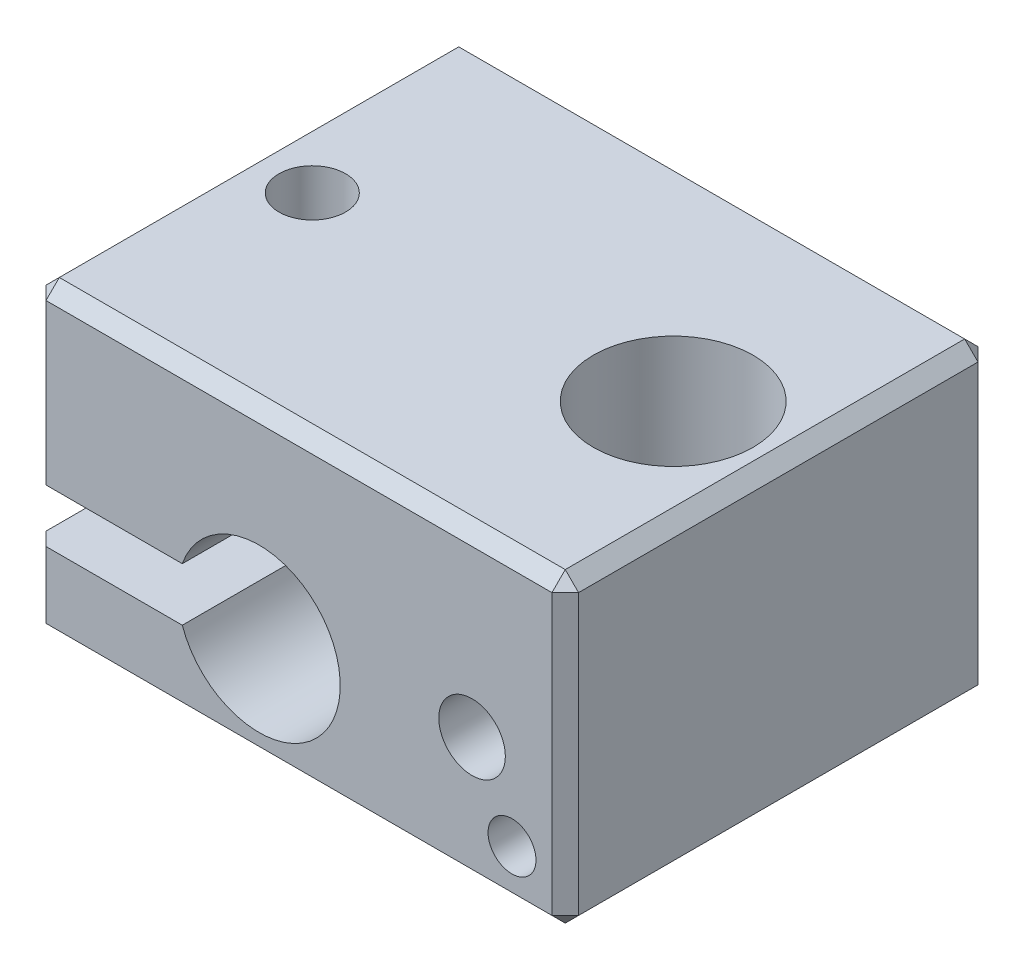
ISO-10303-21;
HEADER;
FILE_DESCRIPTION(('STEP AP214'),'2;1');
FILE_NAME('part.step','',(''),(''),'','','');
FILE_SCHEMA(('AUTOMOTIVE_DESIGN { 1 0 10303 214 1 1 1 1 }'));
ENDSEC;
DATA;
#1=APPLICATION_CONTEXT('core data for automotive mechanical design processes');
#2=APPLICATION_PROTOCOL_DEFINITION('international standard','automotive_design',2000,#1);
#3=PRODUCT_CONTEXT('',#1,'mechanical');
#4=PRODUCT('Part','Part','',(#3));
#5=PRODUCT_RELATED_PRODUCT_CATEGORY('part','',(#4));
#6=PRODUCT_DEFINITION_FORMATION('','',#4);
#7=PRODUCT_DEFINITION_CONTEXT('part definition',#1,'design');
#8=PRODUCT_DEFINITION('design','',#6,#7);
#9=PRODUCT_DEFINITION_SHAPE('','',#8);
#10=(LENGTH_UNIT() NAMED_UNIT(*) SI_UNIT(.MILLI.,.METRE.));
#11=(NAMED_UNIT(*) PLANE_ANGLE_UNIT() SI_UNIT($,.RADIAN.));
#12=(NAMED_UNIT(*) SI_UNIT($,.STERADIAN.) SOLID_ANGLE_UNIT());
#13=UNCERTAINTY_MEASURE_WITH_UNIT(LENGTH_MEASURE(1.E-05),#10,'distance_accuracy_value','');
#14=(GEOMETRIC_REPRESENTATION_CONTEXT(3) GLOBAL_UNCERTAINTY_ASSIGNED_CONTEXT((#13)) GLOBAL_UNIT_ASSIGNED_CONTEXT((#10,
#11,#12)) REPRESENTATION_CONTEXT('',''));
#15=CARTESIAN_POINT('',(0.,0.,0.));
#16=DIRECTION('',(0.,0.,1.));
#17=DIRECTION('',(1.,0.,0.));
#18=AXIS2_PLACEMENT_3D('',#15,#16,#17);
#19=CARTESIAN_POINT('',(10.,-5.75,8.));
#20=DIRECTION('',(-1.,0.,0.));
#21=DIRECTION('',(0.,0.,1.));
#22=AXIS2_PLACEMENT_3D('',#19,#20,#21);
#23=PLANE('',#22);
#24=DIRECTION('',(0.,-1.,0.));
#25=VECTOR('',#24,1.);
#26=CARTESIAN_POINT('',(10.,-5.75,7.5));
#27=LINE('',#26,#25);
#28=CARTESIAN_POINT('',(10.,5.25,7.5));
#29=VERTEX_POINT('',#28);
#30=CARTESIAN_POINT('',(10.,-5.24999999999999,7.5));
#31=VERTEX_POINT('',#30);
#32=EDGE_CURVE('E277',#29,#31,#27,.T.);
#33=ORIENTED_EDGE('',*,*,#32,.T.);
#34=DIRECTION('',(0.,0.,-1.));
#35=VECTOR('',#34,1.);
#36=CARTESIAN_POINT('',(10.,-5.24999999999999,8.));
#37=LINE('',#36,#35);
#38=CARTESIAN_POINT('',(10.,-5.24999999999999,-7.5));
#39=VERTEX_POINT('',#38);
#40=EDGE_CURVE('E281',#31,#39,#37,.T.);
#41=ORIENTED_EDGE('',*,*,#40,.T.);
#42=DIRECTION('',(0.,1.,0.));
#43=VECTOR('',#42,1.);
#44=CARTESIAN_POINT('',(10.,5.75,-7.5));
#45=LINE('',#44,#43);
#46=CARTESIAN_POINT('',(10.,5.25,-7.5));
#47=VERTEX_POINT('',#46);
#48=EDGE_CURVE('E279',#39,#47,#45,.T.);
#49=ORIENTED_EDGE('',*,*,#48,.T.);
#50=DIRECTION('',(0.,0.,1.));
#51=VECTOR('',#50,1.);
#52=CARTESIAN_POINT('',(10.,5.25,8.));
#53=LINE('',#52,#51);
#54=EDGE_CURVE('E275',#47,#29,#53,.T.);
#55=ORIENTED_EDGE('',*,*,#54,.T.);
#56=EDGE_LOOP('',(#33,#41,#49,#55));
#57=FACE_BOUND('',#56,.T.);
#58=ADVANCED_FACE('F34',(#57),#23,.F.);
#59=CARTESIAN_POINT('',(-9.99999999999999,5.75,8.));
#60=DIRECTION('',(0.,-1.,0.));
#61=DIRECTION('',(0.,0.,-1.));
#62=AXIS2_PLACEMENT_3D('',#59,#60,#61);
#63=PLANE('',#62);
#64=CARTESIAN_POINT('',(6.05379989638733,5.75,0.));
#65=DIRECTION('',(0.,1.,0.));
#66=DIRECTION('',(0.,0.,1.));
#67=AXIS2_PLACEMENT_3D('',#64,#65,#66);
#68=CIRCLE('',#67,2.99999999999999);
#69=CARTESIAN_POINT('',(6.05379989638733,5.75,2.99999999999999));
#70=VERTEX_POINT('',#69);
#71=EDGE_CURVE('E831',#70,#70,#68,.T.);
#72=ORIENTED_EDGE('',*,*,#71,.F.);
#73=EDGE_LOOP('',(#72));
#74=FACE_BOUND('',#73,.T.);
#75=CARTESIAN_POINT('',(-7.5,5.75,0.));
#76=DIRECTION('',(0.,1.,0.));
#77=DIRECTION('',(0.,0.,1.));
#78=AXIS2_PLACEMENT_3D('',#75,#76,#77);
#79=CIRCLE('',#78,1.24999999999999);
#80=CARTESIAN_POINT('',(-7.5,5.75,1.24999999999999));
#81=VERTEX_POINT('',#80);
#82=EDGE_CURVE('E823',#81,#81,#79,.T.);
#83=ORIENTED_EDGE('',*,*,#82,.F.);
#84=EDGE_LOOP('',(#83));
#85=FACE_BOUND('',#84,.T.);
#86=DIRECTION('',(1.,0.,0.));
#87=VECTOR('',#86,1.);
#88=CARTESIAN_POINT('',(-9.99999999999999,5.75,7.5));
#89=LINE('',#88,#87);
#90=CARTESIAN_POINT('',(-9.49999999999999,5.75,7.5));
#91=VERTEX_POINT('',#90);
#92=CARTESIAN_POINT('',(9.5,5.75,7.5));
#93=VERTEX_POINT('',#92);
#94=EDGE_CURVE('E58',#91,#93,#89,.T.);
#95=ORIENTED_EDGE('',*,*,#94,.T.);
#96=DIRECTION('',(0.,0.,-1.));
#97=VECTOR('',#96,1.);
#98=CARTESIAN_POINT('',(9.5,5.75,8.));
#99=LINE('',#98,#97);
#100=CARTESIAN_POINT('',(9.5,5.75,-7.5));
#101=VERTEX_POINT('',#100);
#102=EDGE_CURVE('E11',#93,#101,#99,.T.);
#103=ORIENTED_EDGE('',*,*,#102,.T.);
#104=DIRECTION('',(-1.,0.,0.));
#105=VECTOR('',#104,1.);
#106=CARTESIAN_POINT('',(-9.99999999999999,5.75,-7.5));
#107=LINE('',#106,#105);
#108=CARTESIAN_POINT('',(-9.49999999999999,5.75,-7.5));
#109=VERTEX_POINT('',#108);
#110=EDGE_CURVE('E43',#101,#109,#107,.T.);
#111=ORIENTED_EDGE('',*,*,#110,.T.);
#112=DIRECTION('',(0.,0.,1.));
#113=VECTOR('',#112,1.);
#114=CARTESIAN_POINT('',(-9.49999999999999,5.75,8.));
#115=LINE('',#114,#113);
#116=EDGE_CURVE('E284',#109,#91,#115,.T.);
#117=ORIENTED_EDGE('',*,*,#116,.T.);
#118=EDGE_LOOP('',(#95,#103,#111,#117));
#119=FACE_BOUND('',#118,.T.);
#120=ADVANCED_FACE('F372',(#74,#85,#119),#63,.F.);
#121=CARTESIAN_POINT('',(-9.99999999999999,5.75,8.));
#122=DIRECTION('',(1.,0.,0.));
#123=DIRECTION('',(0.,1.,0.));
#124=AXIS2_PLACEMENT_3D('',#121,#122,#123);
#125=PLANE('',#124);
#126=DIRECTION('',(0.,0.,-1.));
#127=VECTOR('',#126,1.);
#128=CARTESIAN_POINT('',(-9.99999999999999,5.25,8.));
#129=LINE('',#128,#127);
#130=CARTESIAN_POINT('',(-9.99999999999999,5.25,7.5));
#131=VERTEX_POINT('',#130);
#132=CARTESIAN_POINT('',(-9.99999999999999,5.25,-7.5));
#133=VERTEX_POINT('',#132);
#134=EDGE_CURVE('E255',#131,#133,#129,.T.);
#135=ORIENTED_EDGE('',*,*,#134,.T.);
#136=DIRECTION('',(0.,-1.,0.));
#137=VECTOR('',#136,1.);
#138=CARTESIAN_POINT('',(-10.,-0.749999999999999,-7.5));
#139=LINE('',#138,#137);
#140=CARTESIAN_POINT('',(-10.,-0.749999999999999,-7.49999999999999));
#141=VERTEX_POINT('',#140);
#142=EDGE_CURVE('E259',#133,#141,#139,.T.);
#143=ORIENTED_EDGE('',*,*,#142,.T.);
#144=DIRECTION('',(0.,0.,-1.));
#145=VECTOR('',#144,1.);
#146=CARTESIAN_POINT('',(-10.,-0.749999999999999,8.));
#147=LINE('',#146,#145);
#148=CARTESIAN_POINT('',(-10.,-0.749999999999999,7.5));
#149=VERTEX_POINT('',#148);
#150=EDGE_CURVE('E222',#149,#141,#147,.T.);
#151=ORIENTED_EDGE('',*,*,#150,.F.);
#152=DIRECTION('',(0.,1.,0.));
#153=VECTOR('',#152,1.);
#154=CARTESIAN_POINT('',(-9.99999999999999,5.75,7.5));
#155=LINE('',#154,#153);
#156=EDGE_CURVE('E257',#149,#131,#155,.T.);
#157=ORIENTED_EDGE('',*,*,#156,.T.);
#158=EDGE_LOOP('',(#135,#143,#151,#157));
#159=FACE_BOUND('',#158,.T.);
#160=ADVANCED_FACE('F397',(#159),#125,.F.);
#161=CARTESIAN_POINT('',(-10.,-0.749999999999999,8.));
#162=DIRECTION('',(0.,1.,0.));
#163=DIRECTION('',(-1.,0.,0.));
#164=AXIS2_PLACEMENT_3D('',#161,#162,#163);
#165=PLANE('',#164);
#166=CARTESIAN_POINT('',(-7.5,-0.749999999999999,0.));
#167=DIRECTION('',(0.,1.,0.));
#168=DIRECTION('',(-1.,0.,0.));
#169=AXIS2_PLACEMENT_3D('',#166,#167,#168);
#170=CIRCLE('',#169,1.24999999999999);
#171=CARTESIAN_POINT('',(-8.74999999999999,-0.749999999999999,0.));
#172=VERTEX_POINT('',#171);
#173=EDGE_CURVE('E177',#172,#172,#170,.T.);
#174=ORIENTED_EDGE('',*,*,#173,.T.);
#175=EDGE_LOOP('',(#174));
#176=FACE_BOUND('',#175,.T.);
#177=ORIENTED_EDGE('',*,*,#150,.T.);
#178=DIRECTION('',(0.707106781186548,0.,-0.707106781186547));
#179=VECTOR('',#178,1.);
#180=CARTESIAN_POINT('',(-10.,-0.749999999999999,-7.5));
#181=LINE('',#180,#179);
#182=CARTESIAN_POINT('',(-9.5,-0.749999999999999,-8.));
#183=VERTEX_POINT('',#182);
#184=EDGE_CURVE('E263',#141,#183,#181,.T.);
#185=ORIENTED_EDGE('',*,*,#184,.T.);
#186=DIRECTION('',(1.,0.,0.));
#187=VECTOR('',#186,1.);
#188=CARTESIAN_POINT('',(-10.,-0.749999999999999,-8.));
#189=LINE('',#188,#187);
#190=CARTESIAN_POINT('',(-4.38140590684478,-0.749999999999998,-8.));
#191=VERTEX_POINT('',#190);
#192=EDGE_CURVE('E207',#183,#191,#189,.T.);
#193=ORIENTED_EDGE('',*,*,#192,.T.);
#194=DIRECTION('',(0.,0.,-1.));
#195=VECTOR('',#194,1.);
#196=CARTESIAN_POINT('',(-4.38140590684478,-0.749999999999998,8.));
#197=LINE('',#196,#195);
#198=CARTESIAN_POINT('',(-4.38140590684478,-0.749999999999998,8.));
#199=VERTEX_POINT('',#198);
#200=EDGE_CURVE('E219',#199,#191,#197,.T.);
#201=ORIENTED_EDGE('',*,*,#200,.F.);
#202=DIRECTION('',(1.,0.,0.));
#203=VECTOR('',#202,1.);
#204=CARTESIAN_POINT('',(-10.,-0.749999999999999,8.));
#205=LINE('',#204,#203);
#206=CARTESIAN_POINT('',(-9.5,-0.749999999999999,8.));
#207=VERTEX_POINT('',#206);
#208=EDGE_CURVE('E198',#207,#199,#205,.T.);
#209=ORIENTED_EDGE('',*,*,#208,.F.);
#210=DIRECTION('',(0.707106781186548,0.,0.707106781186547));
#211=VECTOR('',#210,1.);
#212=CARTESIAN_POINT('',(-9.5,-0.749999999999999,8.));
#213=LINE('',#212,#211);
#214=EDGE_CURVE('E261',#207,#149,#213,.F.);
#215=ORIENTED_EDGE('',*,*,#214,.T.);
#216=EDGE_LOOP('',(#177,#185,#193,#201,#209,#215));
#217=FACE_BOUND('',#216,.T.);
#218=ADVANCED_FACE('F399',(#176,#217),#165,.F.);
#219=CARTESIAN_POINT('',(-1.49999999999999,-1.75,8.));
#220=DIRECTION('',(0.,0.,-1.));
#221=DIRECTION('',(-1.,0.,0.));
#222=AXIS2_PLACEMENT_3D('',#219,#220,#221);
#223=CYLINDRICAL_SURFACE('',#222,3.05);
#224=CARTESIAN_POINT('',(-1.49999999999999,-1.75,-8.));
#225=DIRECTION('',(0.,0.,-1.));
#226=DIRECTION('',(-1.,0.,0.));
#227=AXIS2_PLACEMENT_3D('',#224,#225,#226);
#228=CIRCLE('',#227,3.05);
#229=CARTESIAN_POINT('',(-4.38140590684478,-2.75,-8.));
#230=VERTEX_POINT('',#229);
#231=EDGE_CURVE('E209',#191,#230,#228,.T.);
#232=ORIENTED_EDGE('',*,*,#231,.T.);
#233=DIRECTION('',(0.,0.,-1.));
#234=VECTOR('',#233,1.);
#235=CARTESIAN_POINT('',(-4.38140590684478,-2.75,8.));
#236=LINE('',#235,#234);
#237=CARTESIAN_POINT('',(-4.38140590684478,-2.75,8.));
#238=VERTEX_POINT('',#237);
#239=EDGE_CURVE('E216',#238,#230,#236,.T.);
#240=ORIENTED_EDGE('',*,*,#239,.F.);
#241=CARTESIAN_POINT('',(-1.49999999999999,-1.75,8.));
#242=DIRECTION('',(0.,0.,-1.));
#243=DIRECTION('',(-1.,0.,0.));
#244=AXIS2_PLACEMENT_3D('',#241,#242,#243);
#245=CIRCLE('',#244,3.05);
#246=EDGE_CURVE('E200',#199,#238,#245,.T.);
#247=ORIENTED_EDGE('',*,*,#246,.F.);
#248=ORIENTED_EDGE('',*,*,#200,.T.);
#249=EDGE_LOOP('',(#232,#240,#247,#248));
#250=FACE_BOUND('',#249,.T.);
#251=ADVANCED_FACE('F460',(#250),#223,.F.);
#252=CARTESIAN_POINT('',(-4.38140590684478,-2.75,8.));
#253=DIRECTION('',(0.,-1.,0.));
#254=DIRECTION('',(1.,0.,0.));
#255=AXIS2_PLACEMENT_3D('',#252,#253,#254);
#256=PLANE('',#255);
#257=CARTESIAN_POINT('',(-7.5,-2.75,0.));
#258=DIRECTION('',(0.,-1.,0.));
#259=DIRECTION('',(1.,0.,0.));
#260=AXIS2_PLACEMENT_3D('',#257,#258,#259);
#261=CIRCLE('',#260,1.24999999999999);
#262=CARTESIAN_POINT('',(-6.25000000000001,-2.75,0.));
#263=VERTEX_POINT('',#262);
#264=EDGE_CURVE('E182',#263,#263,#261,.T.);
#265=ORIENTED_EDGE('',*,*,#264,.T.);
#266=EDGE_LOOP('',(#265));
#267=FACE_BOUND('',#266,.T.);
#268=DIRECTION('',(-1.,0.,0.));
#269=VECTOR('',#268,1.);
#270=CARTESIAN_POINT('',(-4.38140590684478,-2.75,-8.));
#271=LINE('',#270,#269);
#272=CARTESIAN_POINT('',(-9.5,-2.75,-8.));
#273=VERTEX_POINT('',#272);
#274=EDGE_CURVE('E201',#230,#273,#271,.T.);
#275=ORIENTED_EDGE('',*,*,#274,.T.);
#276=DIRECTION('',(-0.707106781186546,0.,0.707106781186549));
#277=VECTOR('',#276,1.);
#278=CARTESIAN_POINT('',(-10.,-2.75,-7.5));
#279=LINE('',#278,#277);
#280=CARTESIAN_POINT('',(-10.,-2.75,-7.49999999999999));
#281=VERTEX_POINT('',#280);
#282=EDGE_CURVE('E253',#273,#281,#279,.T.);
#283=ORIENTED_EDGE('',*,*,#282,.T.);
#284=DIRECTION('',(0.,0.,-1.));
#285=VECTOR('',#284,1.);
#286=CARTESIAN_POINT('',(-10.,-2.75,8.));
#287=LINE('',#286,#285);
#288=CARTESIAN_POINT('',(-10.,-2.75,7.5));
#289=VERTEX_POINT('',#288);
#290=EDGE_CURVE('E206',#289,#281,#287,.T.);
#291=ORIENTED_EDGE('',*,*,#290,.F.);
#292=DIRECTION('',(-0.707106781186546,0.,-0.707106781186549));
#293=VECTOR('',#292,1.);
#294=CARTESIAN_POINT('',(-9.5,-2.75,8.));
#295=LINE('',#294,#293);
#296=CARTESIAN_POINT('',(-9.5,-2.75,8.));
#297=VERTEX_POINT('',#296);
#298=EDGE_CURVE('E251',#289,#297,#295,.F.);
#299=ORIENTED_EDGE('',*,*,#298,.T.);
#300=DIRECTION('',(-1.,0.,0.));
#301=VECTOR('',#300,1.);
#302=CARTESIAN_POINT('',(-4.38140590684478,-2.75,8.));
#303=LINE('',#302,#301);
#304=EDGE_CURVE('E203',#238,#297,#303,.T.);
#305=ORIENTED_EDGE('',*,*,#304,.F.);
#306=ORIENTED_EDGE('',*,*,#239,.T.);
#307=EDGE_LOOP('',(#275,#283,#291,#299,#305,#306));
#308=FACE_BOUND('',#307,.T.);
#309=ADVANCED_FACE('F454',(#267,#308),#256,.F.);
#310=CARTESIAN_POINT('',(-10.,-2.75,8.));
#311=DIRECTION('',(1.,0.,0.));
#312=DIRECTION('',(0.,1.,0.));
#313=AXIS2_PLACEMENT_3D('',#310,#311,#312);
#314=PLANE('',#313);
#315=ORIENTED_EDGE('',*,*,#290,.T.);
#316=DIRECTION('',(0.,-1.,0.));
#317=VECTOR('',#316,1.);
#318=CARTESIAN_POINT('',(-9.99999999999999,-5.75,-7.5));
#319=LINE('',#318,#317);
#320=CARTESIAN_POINT('',(-10.,-5.25,-7.5));
#321=VERTEX_POINT('',#320);
#322=EDGE_CURVE('E249',#281,#321,#319,.T.);
#323=ORIENTED_EDGE('',*,*,#322,.T.);
#324=DIRECTION('',(0.,0.,1.));
#325=VECTOR('',#324,1.);
#326=CARTESIAN_POINT('',(-10.,-5.25,8.));
#327=LINE('',#326,#325);
#328=CARTESIAN_POINT('',(-10.,-5.25,7.5));
#329=VERTEX_POINT('',#328);
#330=EDGE_CURVE('E247',#321,#329,#327,.T.);
#331=ORIENTED_EDGE('',*,*,#330,.T.);
#332=DIRECTION('',(0.,1.,0.));
#333=VECTOR('',#332,1.);
#334=CARTESIAN_POINT('',(-10.,-2.75,7.5));
#335=LINE('',#334,#333);
#336=EDGE_CURVE('E245',#329,#289,#335,.T.);
#337=ORIENTED_EDGE('',*,*,#336,.T.);
#338=EDGE_LOOP('',(#315,#323,#331,#337));
#339=FACE_BOUND('',#338,.T.);
#340=ADVANCED_FACE('F611',(#339),#314,.F.);
#341=CARTESIAN_POINT('',(-9.99999999999999,-5.75,8.));
#342=DIRECTION('',(0.,1.,0.));
#343=DIRECTION('',(0.,0.,1.));
#344=AXIS2_PLACEMENT_3D('',#341,#342,#343);
#345=PLANE('',#344);
#346=CARTESIAN_POINT('',(6.05379989638733,-5.74999999999999,0.));
#347=DIRECTION('',(0.,1.,0.));
#348=DIRECTION('',(0.,0.,1.));
#349=AXIS2_PLACEMENT_3D('',#346,#347,#348);
#350=CIRCLE('',#349,2.99999999999999);
#351=CARTESIAN_POINT('',(6.05379989638733,-5.74999999999999,2.99999999999999));
#352=VERTEX_POINT('',#351);
#353=EDGE_CURVE('E828',#352,#352,#350,.T.);
#354=ORIENTED_EDGE('',*,*,#353,.T.);
#355=EDGE_LOOP('',(#354));
#356=FACE_BOUND('',#355,.T.);
#357=CARTESIAN_POINT('',(-7.5,-5.75,0.));
#358=DIRECTION('',(0.,1.,0.));
#359=DIRECTION('',(0.,0.,1.));
#360=AXIS2_PLACEMENT_3D('',#357,#358,#359);
#361=CIRCLE('',#360,1.25);
#362=CARTESIAN_POINT('',(-7.5,-5.75,1.25));
#363=VERTEX_POINT('',#362);
#364=EDGE_CURVE('E821',#363,#363,#361,.T.);
#365=ORIENTED_EDGE('',*,*,#364,.T.);
#366=EDGE_LOOP('',(#365));
#367=FACE_BOUND('',#366,.T.);
#368=DIRECTION('',(0.,0.,-1.));
#369=VECTOR('',#368,1.);
#370=CARTESIAN_POINT('',(-9.49999999999999,-5.75,8.));
#371=LINE('',#370,#369);
#372=CARTESIAN_POINT('',(-9.49999999999999,-5.75,7.5));
#373=VERTEX_POINT('',#372);
#374=CARTESIAN_POINT('',(-9.49999999999999,-5.75,-7.5));
#375=VERTEX_POINT('',#374);
#376=EDGE_CURVE('E229',#373,#375,#371,.T.);
#377=ORIENTED_EDGE('',*,*,#376,.T.);
#378=DIRECTION('',(1.,0.,0.));
#379=VECTOR('',#378,1.);
#380=CARTESIAN_POINT('',(10.,-5.75,-7.5));
#381=LINE('',#380,#379);
#382=CARTESIAN_POINT('',(9.5,-5.75,-7.5));
#383=VERTEX_POINT('',#382);
#384=EDGE_CURVE('E231',#375,#383,#381,.T.);
#385=ORIENTED_EDGE('',*,*,#384,.T.);
#386=DIRECTION('',(0.,0.,1.));
#387=VECTOR('',#386,1.);
#388=CARTESIAN_POINT('',(9.5,-5.75,8.));
#389=LINE('',#388,#387);
#390=CARTESIAN_POINT('',(9.5,-5.75,7.5));
#391=VERTEX_POINT('',#390);
#392=EDGE_CURVE('E225',#383,#391,#389,.T.);
#393=ORIENTED_EDGE('',*,*,#392,.T.);
#394=DIRECTION('',(-1.,0.,0.));
#395=VECTOR('',#394,1.);
#396=CARTESIAN_POINT('',(-9.99999999999999,-5.75,7.5));
#397=LINE('',#396,#395);
#398=EDGE_CURVE('E227',#391,#373,#397,.T.);
#399=ORIENTED_EDGE('',*,*,#398,.T.);
#400=EDGE_LOOP('',(#377,#385,#393,#399));
#401=FACE_BOUND('',#400,.T.);
#402=ADVANCED_FACE('F438',(#356,#367,#401),#345,.F.);
#403=CARTESIAN_POINT('',(-1.49999999999999,-1.75,8.));
#404=DIRECTION('',(0.,0.,-1.));
#405=DIRECTION('',(-1.,0.,0.));
#406=AXIS2_PLACEMENT_3D('',#403,#404,#405);
#407=PLANE('',#406);
#408=CARTESIAN_POINT('',(8.00000000000001,-3.75,8.));
#409=DIRECTION('',(0.,0.,1.));
#410=DIRECTION('',(1.,0.,0.));
#411=AXIS2_PLACEMENT_3D('',#408,#409,#410);
#412=CIRCLE('',#411,0.899999999999989);
#413=CARTESIAN_POINT('',(8.9,-3.75,8.));
#414=VERTEX_POINT('',#413);
#415=EDGE_CURVE('E180',#414,#414,#412,.T.);
#416=ORIENTED_EDGE('',*,*,#415,.F.);
#417=EDGE_LOOP('',(#416));
#418=FACE_BOUND('',#417,.T.);
#419=CARTESIAN_POINT('',(6.50000000000001,-0.949999999999999,8.));
#420=DIRECTION('',(0.,0.,1.));
#421=DIRECTION('',(1.,0.,0.));
#422=AXIS2_PLACEMENT_3D('',#419,#420,#421);
#423=CIRCLE('',#422,1.25);
#424=CARTESIAN_POINT('',(7.75000000000001,-0.949999999999999,8.));
#425=VERTEX_POINT('',#424);
#426=EDGE_CURVE('E191',#425,#425,#423,.T.);
#427=ORIENTED_EDGE('',*,*,#426,.F.);
#428=EDGE_LOOP('',(#427));
#429=FACE_BOUND('',#428,.T.);
#430=ORIENTED_EDGE('',*,*,#304,.T.);
#431=DIRECTION('',(0.,-1.,0.));
#432=VECTOR('',#431,1.);
#433=CARTESIAN_POINT('',(-9.5,-1.75000000000001,8.));
#434=LINE('',#433,#432);
#435=CARTESIAN_POINT('',(-9.49999999999999,-5.24999999999999,8.));
#436=VERTEX_POINT('',#435);
#437=EDGE_CURVE('E273',#297,#436,#434,.T.);
#438=ORIENTED_EDGE('',*,*,#437,.T.);
#439=DIRECTION('',(1.,0.,0.));
#440=VECTOR('',#439,1.);
#441=CARTESIAN_POINT('',(-1.49999999999999,-5.24999999999999,8.));
#442=LINE('',#441,#440);
#443=CARTESIAN_POINT('',(9.5,-5.24999999999999,8.));
#444=VERTEX_POINT('',#443);
#445=EDGE_CURVE('E271',#436,#444,#442,.T.);
#446=ORIENTED_EDGE('',*,*,#445,.T.);
#447=DIRECTION('',(0.,1.,0.));
#448=VECTOR('',#447,1.);
#449=CARTESIAN_POINT('',(9.5,-1.75,8.));
#450=LINE('',#449,#448);
#451=CARTESIAN_POINT('',(9.5,5.25,8.));
#452=VERTEX_POINT('',#451);
#453=EDGE_CURVE('E267',#444,#452,#450,.T.);
#454=ORIENTED_EDGE('',*,*,#453,.T.);
#455=DIRECTION('',(-1.,0.,0.));
#456=VECTOR('',#455,1.);
#457=CARTESIAN_POINT('',(-1.49999999999999,5.25,8.));
#458=LINE('',#457,#456);
#459=CARTESIAN_POINT('',(-9.49999999999999,5.25,8.));
#460=VERTEX_POINT('',#459);
#461=EDGE_CURVE('E265',#452,#460,#458,.T.);
#462=ORIENTED_EDGE('',*,*,#461,.T.);
#463=DIRECTION('',(0.,-1.,0.));
#464=VECTOR('',#463,1.);
#465=CARTESIAN_POINT('',(-9.5,-1.74999999999999,8.));
#466=LINE('',#465,#464);
#467=EDGE_CURVE('E269',#460,#207,#466,.T.);
#468=ORIENTED_EDGE('',*,*,#467,.T.);
#469=ORIENTED_EDGE('',*,*,#208,.T.);
#470=ORIENTED_EDGE('',*,*,#246,.T.);
#471=EDGE_LOOP('',(#430,#438,#446,#454,#462,#468,#469,#470));
#472=FACE_BOUND('',#471,.T.);
#473=ADVANCED_FACE('F404',(#418,#429,#472),#407,.F.);
#474=CARTESIAN_POINT('',(-1.49999999999999,-1.75,-8.));
#475=DIRECTION('',(0.,0.,-1.));
#476=DIRECTION('',(-1.,0.,0.));
#477=AXIS2_PLACEMENT_3D('',#474,#475,#476);
#478=PLANE('',#477);
#479=DIRECTION('',(-1.,0.,0.));
#480=VECTOR('',#479,1.);
#481=CARTESIAN_POINT('',(-9.99999999999999,-5.24999999999999,-8.));
#482=LINE('',#481,#480);
#483=CARTESIAN_POINT('',(9.5,-5.24999999999999,-8.));
#484=VERTEX_POINT('',#483);
#485=CARTESIAN_POINT('',(-9.49999999999999,-5.24999999999999,-8.));
#486=VERTEX_POINT('',#485);
#487=EDGE_CURVE('E240',#484,#486,#482,.T.);
#488=ORIENTED_EDGE('',*,*,#487,.T.);
#489=DIRECTION('',(0.,1.,0.));
#490=VECTOR('',#489,1.);
#491=CARTESIAN_POINT('',(-9.5,-2.75,-8.));
#492=LINE('',#491,#490);
#493=EDGE_CURVE('E243',#486,#273,#492,.T.);
#494=ORIENTED_EDGE('',*,*,#493,.T.);
#495=ORIENTED_EDGE('',*,*,#274,.F.);
#496=ORIENTED_EDGE('',*,*,#231,.F.);
#497=ORIENTED_EDGE('',*,*,#192,.F.);
#498=DIRECTION('',(0.,1.,0.));
#499=VECTOR('',#498,1.);
#500=CARTESIAN_POINT('',(-9.49999999999999,5.75,-8.));
#501=LINE('',#500,#499);
#502=CARTESIAN_POINT('',(-9.49999999999999,5.25,-8.));
#503=VERTEX_POINT('',#502);
#504=EDGE_CURVE('E238',#183,#503,#501,.T.);
#505=ORIENTED_EDGE('',*,*,#504,.T.);
#506=DIRECTION('',(1.,0.,0.));
#507=VECTOR('',#506,1.);
#508=CARTESIAN_POINT('',(10.,5.25,-8.));
#509=LINE('',#508,#507);
#510=CARTESIAN_POINT('',(9.5,5.25,-8.));
#511=VERTEX_POINT('',#510);
#512=EDGE_CURVE('E234',#503,#511,#509,.T.);
#513=ORIENTED_EDGE('',*,*,#512,.T.);
#514=DIRECTION('',(0.,-1.,0.));
#515=VECTOR('',#514,1.);
#516=CARTESIAN_POINT('',(9.5,-5.75,-8.));
#517=LINE('',#516,#515);
#518=EDGE_CURVE('E236',#511,#484,#517,.T.);
#519=ORIENTED_EDGE('',*,*,#518,.T.);
#520=EDGE_LOOP('',(#488,#494,#495,#496,#497,#505,#513,#519));
#521=FACE_BOUND('',#520,.T.);
#522=ADVANCED_FACE('F385',(#521),#478,.T.);
#523=CARTESIAN_POINT('',(-9.5,-1.74999999999999,8.));
#524=DIRECTION('',(0.707106781186547,0.,-0.707106781186548));
#525=DIRECTION('',(0.,-1.,0.));
#526=AXIS2_PLACEMENT_3D('',#523,#524,#525);
#527=PLANE('',#526);
#528=DIRECTION('',(-0.707106781186548,0.,-0.707106781186547));
#529=VECTOR('',#528,1.);
#530=CARTESIAN_POINT('',(-9.99999999999999,5.25,7.5));
#531=LINE('',#530,#529);
#532=EDGE_CURVE('E210',#131,#460,#531,.F.);
#533=ORIENTED_EDGE('',*,*,#532,.F.);
#534=ORIENTED_EDGE('',*,*,#156,.F.);
#535=ORIENTED_EDGE('',*,*,#214,.F.);
#536=ORIENTED_EDGE('',*,*,#467,.F.);
#537=EDGE_LOOP('',(#533,#534,#535,#536));
#538=FACE_BOUND('',#537,.T.);
#539=ADVANCED_FACE('F36',(#538),#527,.F.);
#540=CARTESIAN_POINT('',(-9.99999999999999,5.25,7.5));
#541=DIRECTION('',(-0.577350269189626,0.577350269189626,0.577350269189626));
#542=DIRECTION('',(0.707106781186547,0.,0.707106781186547));
#543=AXIS2_PLACEMENT_3D('',#540,#541,#542);
#544=PLANE('',#543);
#545=DIRECTION('',(0.707106781186547,0.707106781186547,0.));
#546=VECTOR('',#545,1.);
#547=CARTESIAN_POINT('',(-9.99999999999999,5.25,7.5));
#548=LINE('',#547,#546);
#549=EDGE_CURVE('E344',#131,#91,#548,.T.);
#550=ORIENTED_EDGE('',*,*,#549,.F.);
#551=ORIENTED_EDGE('',*,*,#532,.T.);
#552=DIRECTION('',(0.,-0.707106781186547,0.707106781186547));
#553=VECTOR('',#552,1.);
#554=CARTESIAN_POINT('',(-9.49999999999999,5.5,7.75));
#555=LINE('',#554,#553);
#556=EDGE_CURVE('E347',#91,#460,#555,.T.);
#557=ORIENTED_EDGE('',*,*,#556,.F.);
#558=EDGE_LOOP('',(#550,#551,#557));
#559=FACE_BOUND('',#558,.T.);
#560=ADVANCED_FACE('F354',(#559),#544,.T.);
#561=CARTESIAN_POINT('',(-1.49999999999999,5.25,8.));
#562=DIRECTION('',(0.,-0.707106781186547,-0.707106781186547));
#563=DIRECTION('',(-1.,0.,0.));
#564=AXIS2_PLACEMENT_3D('',#561,#562,#563);
#565=PLANE('',#564);
#566=ORIENTED_EDGE('',*,*,#556,.T.);
#567=ORIENTED_EDGE('',*,*,#461,.F.);
#568=DIRECTION('',(0.,0.707106781186547,-0.707106781186547));
#569=VECTOR('',#568,1.);
#570=CARTESIAN_POINT('',(9.5,5.25,8.));
#571=LINE('',#570,#569);
#572=EDGE_CURVE('E341',#93,#452,#571,.F.);
#573=ORIENTED_EDGE('',*,*,#572,.F.);
#574=ORIENTED_EDGE('',*,*,#94,.F.);
#575=EDGE_LOOP('',(#566,#567,#573,#574));
#576=FACE_BOUND('',#575,.T.);
#577=ADVANCED_FACE('F361',(#576),#565,.F.);
#578=CARTESIAN_POINT('',(-9.99999999999999,5.25,8.));
#579=DIRECTION('',(0.707106781186547,-0.707106781186547,0.));
#580=DIRECTION('',(0.,0.,-1.));
#581=AXIS2_PLACEMENT_3D('',#578,#579,#580);
#582=PLANE('',#581);
#583=ORIENTED_EDGE('',*,*,#549,.T.);
#584=ORIENTED_EDGE('',*,*,#116,.F.);
#585=DIRECTION('',(-0.707106781186547,-0.707106781186547,0.));
#586=VECTOR('',#585,1.);
#587=CARTESIAN_POINT('',(-9.74999999999999,5.5,-7.5));
#588=LINE('',#587,#586);
#589=EDGE_CURVE('E338',#133,#109,#588,.F.);
#590=ORIENTED_EDGE('',*,*,#589,.F.);
#591=ORIENTED_EDGE('',*,*,#134,.F.);
#592=EDGE_LOOP('',(#583,#584,#590,#591));
#593=FACE_BOUND('',#592,.T.);
#594=ADVANCED_FACE('F377',(#593),#582,.F.);
#595=CARTESIAN_POINT('',(-9.99999999999999,5.75,-7.5));
#596=DIRECTION('',(-0.707106781186547,0.,-0.707106781186548));
#597=DIRECTION('',(0.,1.,0.));
#598=AXIS2_PLACEMENT_3D('',#595,#596,#597);
#599=PLANE('',#598);
#600=ORIENTED_EDGE('',*,*,#184,.F.);
#601=ORIENTED_EDGE('',*,*,#142,.F.);
#602=DIRECTION('',(-0.707106781186548,0.,0.707106781186547));
#603=VECTOR('',#602,1.);
#604=CARTESIAN_POINT('',(-9.49999999999999,5.25,-8.));
#605=LINE('',#604,#603);
#606=EDGE_CURVE('E335',#503,#133,#605,.T.);
#607=ORIENTED_EDGE('',*,*,#606,.F.);
#608=ORIENTED_EDGE('',*,*,#504,.F.);
#609=EDGE_LOOP('',(#600,#601,#607,#608));
#610=FACE_BOUND('',#609,.T.);
#611=ADVANCED_FACE('F394',(#610),#599,.T.);
#612=CARTESIAN_POINT('',(9.5,5.25,8.));
#613=DIRECTION('',(0.577350269189626,0.577350269189626,0.577350269189626));
#614=DIRECTION('',(0.707106781186547,0.,-0.707106781186547));
#615=AXIS2_PLACEMENT_3D('',#612,#613,#614);
#616=PLANE('',#615);
#617=DIRECTION('',(0.707106781186547,-0.707106781186547,0.));
#618=VECTOR('',#617,1.);
#619=CARTESIAN_POINT('',(9.75,5.5,7.5));
#620=LINE('',#619,#618);
#621=EDGE_CURVE('E329',#93,#29,#620,.T.);
#622=ORIENTED_EDGE('',*,*,#621,.F.);
#623=ORIENTED_EDGE('',*,*,#572,.T.);
#624=DIRECTION('',(-0.707106781186547,0.,0.707106781186547));
#625=VECTOR('',#624,1.);
#626=CARTESIAN_POINT('',(9.5,5.25,8.));
#627=LINE('',#626,#625);
#628=EDGE_CURVE('E332',#29,#452,#627,.T.);
#629=ORIENTED_EDGE('',*,*,#628,.F.);
#630=EDGE_LOOP('',(#622,#623,#629));
#631=FACE_BOUND('',#630,.T.);
#632=ADVANCED_FACE('F366',(#631),#616,.T.);
#633=CARTESIAN_POINT('',(-9.49999999999999,5.25,-8.));
#634=DIRECTION('',(-0.577350269189626,0.577350269189626,-0.577350269189626));
#635=DIRECTION('',(-0.707106781186547,0.,0.707106781186547));
#636=AXIS2_PLACEMENT_3D('',#633,#634,#635);
#637=PLANE('',#636);
#638=ORIENTED_EDGE('',*,*,#606,.T.);
#639=ORIENTED_EDGE('',*,*,#589,.T.);
#640=DIRECTION('',(0.,-0.707106781186547,-0.707106781186547));
#641=VECTOR('',#640,1.);
#642=CARTESIAN_POINT('',(-9.49999999999999,5.25,-8.));
#643=LINE('',#642,#641);
#644=EDGE_CURVE('E326',#503,#109,#643,.F.);
#645=ORIENTED_EDGE('',*,*,#644,.F.);
#646=EDGE_LOOP('',(#638,#639,#645));
#647=FACE_BOUND('',#646,.T.);
#648=ADVANCED_FACE('F380',(#647),#637,.T.);
#649=CARTESIAN_POINT('',(-9.5,-1.75000000000001,8.));
#650=DIRECTION('',(0.707106781186549,0.,-0.707106781186546));
#651=DIRECTION('',(0.,-1.,0.));
#652=AXIS2_PLACEMENT_3D('',#649,#650,#651);
#653=PLANE('',#652);
#654=ORIENTED_EDGE('',*,*,#298,.F.);
#655=ORIENTED_EDGE('',*,*,#336,.F.);
#656=DIRECTION('',(0.707106781186546,0.,0.707106781186549));
#657=VECTOR('',#656,1.);
#658=CARTESIAN_POINT('',(-10.,-5.25,7.5));
#659=LINE('',#658,#657);
#660=EDGE_CURVE('E323',#436,#329,#659,.F.);
#661=ORIENTED_EDGE('',*,*,#660,.F.);
#662=ORIENTED_EDGE('',*,*,#437,.F.);
#663=EDGE_LOOP('',(#654,#655,#661,#662));
#664=FACE_BOUND('',#663,.T.);
#665=ADVANCED_FACE('F464',(#664),#653,.F.);
#666=CARTESIAN_POINT('',(-1.49999999999999,-5.24999999999999,8.));
#667=DIRECTION('',(0.,0.707106781186547,-0.707106781186547));
#668=DIRECTION('',(1.,0.,0.));
#669=AXIS2_PLACEMENT_3D('',#666,#667,#668);
#670=PLANE('',#669);
#671=DIRECTION('',(0.,0.707106781186547,0.707106781186547));
#672=VECTOR('',#671,1.);
#673=CARTESIAN_POINT('',(9.5,-5.24999999999999,8.));
#674=LINE('',#673,#672);
#675=EDGE_CURVE('E317',#444,#391,#674,.F.);
#676=ORIENTED_EDGE('',*,*,#675,.F.);
#677=ORIENTED_EDGE('',*,*,#445,.F.);
#678=DIRECTION('',(0.,-0.707106781186547,-0.707106781186547));
#679=VECTOR('',#678,1.);
#680=CARTESIAN_POINT('',(-9.49999999999999,-5.5,7.75));
#681=LINE('',#680,#679);
#682=EDGE_CURVE('E320',#373,#436,#681,.F.);
#683=ORIENTED_EDGE('',*,*,#682,.F.);
#684=ORIENTED_EDGE('',*,*,#398,.F.);
#685=EDGE_LOOP('',(#676,#677,#683,#684));
#686=FACE_BOUND('',#685,.T.);
#687=ADVANCED_FACE('F414',(#686),#670,.F.);
#688=CARTESIAN_POINT('',(9.5,-1.75,8.));
#689=DIRECTION('',(-0.707106781186547,0.,-0.707106781186547));
#690=DIRECTION('',(0.,1.,0.));
#691=AXIS2_PLACEMENT_3D('',#688,#689,#690);
#692=PLANE('',#691);
#693=ORIENTED_EDGE('',*,*,#628,.T.);
#694=ORIENTED_EDGE('',*,*,#453,.F.);
#695=DIRECTION('',(0.707106781186547,0.,-0.707106781186547));
#696=VECTOR('',#695,1.);
#697=CARTESIAN_POINT('',(9.5,-5.24999999999999,8.));
#698=LINE('',#697,#696);
#699=EDGE_CURVE('E314',#31,#444,#698,.F.);
#700=ORIENTED_EDGE('',*,*,#699,.F.);
#701=ORIENTED_EDGE('',*,*,#32,.F.);
#702=EDGE_LOOP('',(#693,#694,#700,#701));
#703=FACE_BOUND('',#702,.T.);
#704=ADVANCED_FACE('F410',(#703),#692,.F.);
#705=CARTESIAN_POINT('',(9.5,5.75,8.));
#706=DIRECTION('',(-0.707106781186547,-0.707106781186547,0.));
#707=DIRECTION('',(0.,0.,-1.));
#708=AXIS2_PLACEMENT_3D('',#705,#706,#707);
#709=PLANE('',#708);
#710=ORIENTED_EDGE('',*,*,#621,.T.);
#711=ORIENTED_EDGE('',*,*,#54,.F.);
#712=DIRECTION('',(-0.707106781186547,0.707106781186547,0.));
#713=VECTOR('',#712,1.);
#714=CARTESIAN_POINT('',(10.,5.25,-7.5));
#715=LINE('',#714,#713);
#716=EDGE_CURVE('E312',#101,#47,#715,.F.);
#717=ORIENTED_EDGE('',*,*,#716,.F.);
#718=ORIENTED_EDGE('',*,*,#102,.F.);
#719=EDGE_LOOP('',(#710,#711,#717,#718));
#720=FACE_BOUND('',#719,.T.);
#721=ADVANCED_FACE('F370',(#720),#709,.F.);
#722=CARTESIAN_POINT('',(-9.99999999999999,5.75,-7.5));
#723=DIRECTION('',(0.,0.707106781186547,-0.707106781186547));
#724=DIRECTION('',(1.,0.,0.));
#725=AXIS2_PLACEMENT_3D('',#722,#723,#724);
#726=PLANE('',#725);
#727=ORIENTED_EDGE('',*,*,#644,.T.);
#728=ORIENTED_EDGE('',*,*,#110,.F.);
#729=DIRECTION('',(0.,0.707106781186547,0.707106781186547));
#730=VECTOR('',#729,1.);
#731=CARTESIAN_POINT('',(9.5,5.5,-7.75));
#732=LINE('',#731,#730);
#733=EDGE_CURVE('E51',#511,#101,#732,.T.);
#734=ORIENTED_EDGE('',*,*,#733,.F.);
#735=ORIENTED_EDGE('',*,*,#512,.F.);
#736=EDGE_LOOP('',(#727,#728,#734,#735));
#737=FACE_BOUND('',#736,.T.);
#738=ADVANCED_FACE('F383',(#737),#726,.T.);
#739=CARTESIAN_POINT('',(-10.,-5.25,7.5));
#740=DIRECTION('',(-0.577350269189625,-0.577350269189627,0.577350269189625));
#741=DIRECTION('',(0.707106781186549,-0.707106781186546,0.));
#742=AXIS2_PLACEMENT_3D('',#739,#740,#741);
#743=PLANE('',#742);
#744=ORIENTED_EDGE('',*,*,#682,.T.);
#745=ORIENTED_EDGE('',*,*,#660,.T.);
#746=DIRECTION('',(-0.707106781186548,0.707106781186547,0.));
#747=VECTOR('',#746,1.);
#748=CARTESIAN_POINT('',(-10.,-5.25,7.5));
#749=LINE('',#748,#747);
#750=EDGE_CURVE('E308',#373,#329,#749,.T.);
#751=ORIENTED_EDGE('',*,*,#750,.F.);
#752=EDGE_LOOP('',(#744,#745,#751));
#753=FACE_BOUND('',#752,.T.);
#754=ADVANCED_FACE('F468',(#753),#743,.T.);
#755=CARTESIAN_POINT('',(9.5,-5.24999999999999,8.));
#756=DIRECTION('',(0.577350269189626,-0.577350269189626,0.577350269189626));
#757=DIRECTION('',(0.707106781186547,0.,-0.707106781186547));
#758=AXIS2_PLACEMENT_3D('',#755,#756,#757);
#759=PLANE('',#758);
#760=ORIENTED_EDGE('',*,*,#699,.T.);
#761=ORIENTED_EDGE('',*,*,#675,.T.);
#762=DIRECTION('',(-0.707106781186547,-0.707106781186547,0.));
#763=VECTOR('',#762,1.);
#764=CARTESIAN_POINT('',(9.75,-5.5,7.5));
#765=LINE('',#764,#763);
#766=EDGE_CURVE('E305',#31,#391,#765,.T.);
#767=ORIENTED_EDGE('',*,*,#766,.F.);
#768=EDGE_LOOP('',(#760,#761,#767));
#769=FACE_BOUND('',#768,.T.);
#770=ADVANCED_FACE('F418',(#769),#759,.T.);
#771=CARTESIAN_POINT('',(10.,5.25,-7.5));
#772=DIRECTION('',(0.577350269189626,0.577350269189626,-0.577350269189626));
#773=DIRECTION('',(-0.707106781186547,0.,-0.707106781186547));
#774=AXIS2_PLACEMENT_3D('',#771,#772,#773);
#775=PLANE('',#774);
#776=ORIENTED_EDGE('',*,*,#733,.T.);
#777=ORIENTED_EDGE('',*,*,#716,.T.);
#778=DIRECTION('',(-0.707106781186547,0.,-0.707106781186547));
#779=VECTOR('',#778,1.);
#780=CARTESIAN_POINT('',(10.,5.25,-7.5));
#781=LINE('',#780,#779);
#782=EDGE_CURVE('E302',#511,#47,#781,.F.);
#783=ORIENTED_EDGE('',*,*,#782,.F.);
#784=EDGE_LOOP('',(#776,#777,#783));
#785=FACE_BOUND('',#784,.T.);
#786=ADVANCED_FACE('F426',(#785),#775,.T.);
#787=CARTESIAN_POINT('',(-10.,-2.75,-7.5));
#788=DIRECTION('',(-0.707106781186549,0.,-0.707106781186546));
#789=DIRECTION('',(0.,1.,0.));
#790=AXIS2_PLACEMENT_3D('',#787,#788,#789);
#791=PLANE('',#790);
#792=ORIENTED_EDGE('',*,*,#282,.F.);
#793=ORIENTED_EDGE('',*,*,#493,.F.);
#794=DIRECTION('',(0.707106781186546,0.,-0.707106781186549));
#795=VECTOR('',#794,1.);
#796=CARTESIAN_POINT('',(-9.49999999999999,-5.25,-8.));
#797=LINE('',#796,#795);
#798=EDGE_CURVE('E299',#321,#486,#797,.T.);
#799=ORIENTED_EDGE('',*,*,#798,.F.);
#800=ORIENTED_EDGE('',*,*,#322,.F.);
#801=EDGE_LOOP('',(#792,#793,#799,#800));
#802=FACE_BOUND('',#801,.T.);
#803=ADVANCED_FACE('F451',(#802),#791,.T.);
#804=CARTESIAN_POINT('',(-9.49999999999999,-5.75,8.));
#805=DIRECTION('',(0.707106781186547,0.707106781186548,0.));
#806=DIRECTION('',(0.,0.,-1.));
#807=AXIS2_PLACEMENT_3D('',#804,#805,#806);
#808=PLANE('',#807);
#809=ORIENTED_EDGE('',*,*,#750,.T.);
#810=ORIENTED_EDGE('',*,*,#330,.F.);
#811=DIRECTION('',(0.707106781186548,-0.707106781186547,0.));
#812=VECTOR('',#811,1.);
#813=CARTESIAN_POINT('',(-9.75,-5.5,-7.5));
#814=LINE('',#813,#812);
#815=EDGE_CURVE('E296',#375,#321,#814,.F.);
#816=ORIENTED_EDGE('',*,*,#815,.F.);
#817=ORIENTED_EDGE('',*,*,#376,.F.);
#818=EDGE_LOOP('',(#809,#810,#816,#817));
#819=FACE_BOUND('',#818,.T.);
#820=ADVANCED_FACE('F443',(#819),#808,.F.);
#821=CARTESIAN_POINT('',(10.,-5.24999999999999,8.));
#822=DIRECTION('',(-0.707106781186547,0.707106781186547,0.));
#823=DIRECTION('',(0.,0.,-1.));
#824=AXIS2_PLACEMENT_3D('',#821,#822,#823);
#825=PLANE('',#824);
#826=ORIENTED_EDGE('',*,*,#766,.T.);
#827=ORIENTED_EDGE('',*,*,#392,.F.);
#828=DIRECTION('',(0.707106781186547,0.707106781186547,0.));
#829=VECTOR('',#828,1.);
#830=CARTESIAN_POINT('',(9.5,-5.75,-7.5));
#831=LINE('',#830,#829);
#832=EDGE_CURVE('E293',#39,#383,#831,.F.);
#833=ORIENTED_EDGE('',*,*,#832,.F.);
#834=ORIENTED_EDGE('',*,*,#40,.F.);
#835=EDGE_LOOP('',(#826,#827,#833,#834));
#836=FACE_BOUND('',#835,.T.);
#837=ADVANCED_FACE('F423',(#836),#825,.F.);
#838=CARTESIAN_POINT('',(10.,-5.75,-7.5));
#839=DIRECTION('',(0.707106781186547,0.,-0.707106781186547));
#840=DIRECTION('',(0.,-1.,0.));
#841=AXIS2_PLACEMENT_3D('',#838,#839,#840);
#842=PLANE('',#841);
#843=ORIENTED_EDGE('',*,*,#782,.T.);
#844=ORIENTED_EDGE('',*,*,#48,.F.);
#845=DIRECTION('',(0.707106781186547,0.,0.707106781186547));
#846=VECTOR('',#845,1.);
#847=CARTESIAN_POINT('',(9.75,-5.24999999999999,-7.75));
#848=LINE('',#847,#846);
#849=EDGE_CURVE('E291',#484,#39,#848,.T.);
#850=ORIENTED_EDGE('',*,*,#849,.F.);
#851=ORIENTED_EDGE('',*,*,#518,.F.);
#852=EDGE_LOOP('',(#843,#844,#850,#851));
#853=FACE_BOUND('',#852,.T.);
#854=ADVANCED_FACE('F428',(#853),#842,.T.);
#855=CARTESIAN_POINT('',(-9.49999999999999,-5.24999999999999,-8.));
#856=DIRECTION('',(-0.577350269189625,-0.577350269189627,-0.577350269189625));
#857=DIRECTION('',(0.,0.707106781186546,-0.707106781186549));
#858=AXIS2_PLACEMENT_3D('',#855,#856,#857);
#859=PLANE('',#858);
#860=ORIENTED_EDGE('',*,*,#815,.T.);
#861=ORIENTED_EDGE('',*,*,#798,.T.);
#862=DIRECTION('',(0.,-0.707106781186548,0.707106781186548));
#863=VECTOR('',#862,1.);
#864=CARTESIAN_POINT('',(-9.49999999999999,-5.24999999999999,-8.));
#865=LINE('',#864,#863);
#866=EDGE_CURVE('E289',#375,#486,#865,.F.);
#867=ORIENTED_EDGE('',*,*,#866,.F.);
#868=EDGE_LOOP('',(#860,#861,#867));
#869=FACE_BOUND('',#868,.T.);
#870=ADVANCED_FACE('F446',(#869),#859,.T.);
#871=CARTESIAN_POINT('',(9.5,-5.75,-7.5));
#872=DIRECTION('',(0.577350269189626,-0.577350269189626,-0.577350269189626));
#873=DIRECTION('',(-0.707106781186547,0.,-0.707106781186547));
#874=AXIS2_PLACEMENT_3D('',#871,#872,#873);
#875=PLANE('',#874);
#876=ORIENTED_EDGE('',*,*,#849,.T.);
#877=ORIENTED_EDGE('',*,*,#832,.T.);
#878=DIRECTION('',(0.,0.707106781186547,-0.707106781186547));
#879=VECTOR('',#878,1.);
#880=CARTESIAN_POINT('',(9.5,-5.75,-7.5));
#881=LINE('',#880,#879);
#882=EDGE_CURVE('E197',#484,#383,#881,.F.);
#883=ORIENTED_EDGE('',*,*,#882,.F.);
#884=EDGE_LOOP('',(#876,#877,#883));
#885=FACE_BOUND('',#884,.T.);
#886=ADVANCED_FACE('F436',(#885),#875,.T.);
#887=CARTESIAN_POINT('',(-9.99999999999999,-5.75,-7.5));
#888=DIRECTION('',(0.,-0.707106781186547,-0.707106781186547));
#889=DIRECTION('',(-1.,0.,0.));
#890=AXIS2_PLACEMENT_3D('',#887,#888,#889);
#891=PLANE('',#890);
#892=ORIENTED_EDGE('',*,*,#866,.T.);
#893=ORIENTED_EDGE('',*,*,#487,.F.);
#894=ORIENTED_EDGE('',*,*,#882,.T.);
#895=ORIENTED_EDGE('',*,*,#384,.F.);
#896=EDGE_LOOP('',(#892,#893,#894,#895));
#897=FACE_BOUND('',#896,.T.);
#898=ADVANCED_FACE('F433',(#897),#891,.T.);
#899=CARTESIAN_POINT('',(6.50000000000001,-0.949999999999999,4.5));
#900=DIRECTION('',(0.,0.,1.));
#901=DIRECTION('',(1.,0.,0.));
#902=AXIS2_PLACEMENT_3D('',#899,#900,#901);
#903=CONICAL_SURFACE('',#902,1.25,1.02974425867665);
#904=CARTESIAN_POINT('',(6.50000000000001,-0.949999999999999,3.74892422621555));
#905=VERTEX_POINT('',#904);
#906=VERTEX_LOOP('',#905);
#907=FACE_BOUND('',#906,.T.);
#908=CARTESIAN_POINT('',(6.50000000000001,-0.949999999999999,4.5));
#909=DIRECTION('',(0.,0.,1.));
#910=DIRECTION('',(1.,0.,0.));
#911=AXIS2_PLACEMENT_3D('',#908,#909,#910);
#912=CIRCLE('',#911,1.25);
#913=CARTESIAN_POINT('',(7.75,-0.949999999999999,4.5));
#914=VERTEX_POINT('',#913);
#915=EDGE_CURVE('E194',#914,#914,#912,.T.);
#916=ORIENTED_EDGE('',*,*,#915,.T.);
#917=EDGE_LOOP('',(#916));
#918=FACE_BOUND('',#917,.T.);
#919=ADVANCED_FACE('F488',(#907,#918),#903,.F.);
#920=CARTESIAN_POINT('',(6.50000000000001,-0.949999999999999,8.));
#921=DIRECTION('',(0.,0.,1.));
#922=DIRECTION('',(1.,0.,0.));
#923=AXIS2_PLACEMENT_3D('',#920,#921,#922);
#924=CYLINDRICAL_SURFACE('',#923,1.25);
#925=ORIENTED_EDGE('',*,*,#915,.F.);
#926=EDGE_LOOP('',(#925));
#927=FACE_BOUND('',#926,.T.);
#928=ORIENTED_EDGE('',*,*,#426,.T.);
#929=EDGE_LOOP('',(#928));
#930=FACE_BOUND('',#929,.T.);
#931=ADVANCED_FACE('F540',(#927,#930),#924,.F.);
#932=CARTESIAN_POINT('',(8.00000000000001,-3.75,6.));
#933=DIRECTION('',(0.,0.,1.));
#934=DIRECTION('',(1.,0.,0.));
#935=AXIS2_PLACEMENT_3D('',#932,#933,#934);
#936=CONICAL_SURFACE('',#935,0.899999999999998,1.02974425867665);
#937=CARTESIAN_POINT('',(8.00000000000001,-3.75,5.93991393809724));
#938=DIRECTION('',(0.,0.,1.));
#939=DIRECTION('',(1.,0.,0.));
#940=AXIS2_PLACEMENT_3D('',#937,#938,#939);
#941=CIRCLE('',#940,0.799999999999999);
#942=CARTESIAN_POINT('',(8.80000000000001,-3.75,5.93991393809724));
#943=VERTEX_POINT('',#942);
#944=EDGE_CURVE('E38',#943,#943,#941,.F.);
#945=ORIENTED_EDGE('',*,*,#944,.T.);
#946=EDGE_LOOP('',(#945));
#947=FACE_BOUND('',#946,.T.);
#948=CARTESIAN_POINT('',(8.00000000000001,-3.75,6.));
#949=DIRECTION('',(0.,0.,1.));
#950=DIRECTION('',(1.,0.,0.));
#951=AXIS2_PLACEMENT_3D('',#948,#949,#950);
#952=CIRCLE('',#951,0.899999999999998);
#953=CARTESIAN_POINT('',(8.9,-3.75,6.));
#954=VERTEX_POINT('',#953);
#955=EDGE_CURVE('E188',#954,#954,#952,.T.);
#956=ORIENTED_EDGE('',*,*,#955,.T.);
#957=EDGE_LOOP('',(#956));
#958=FACE_BOUND('',#957,.T.);
#959=ADVANCED_FACE('F549',(#947,#958),#936,.F.);
#960=CARTESIAN_POINT('',(8.00000000000001,-3.75,8.));
#961=DIRECTION('',(0.,0.,1.));
#962=DIRECTION('',(1.,0.,0.));
#963=AXIS2_PLACEMENT_3D('',#960,#961,#962);
#964=CYLINDRICAL_SURFACE('',#963,0.899999999999994);
#965=ORIENTED_EDGE('',*,*,#955,.F.);
#966=EDGE_LOOP('',(#965));
#967=FACE_BOUND('',#966,.T.);
#968=ORIENTED_EDGE('',*,*,#415,.T.);
#969=EDGE_LOOP('',(#968));
#970=FACE_BOUND('',#969,.T.);
#971=ADVANCED_FACE('F557',(#967,#970),#964,.F.);
#972=CARTESIAN_POINT('',(8.00000000000001,-3.75,8.));
#973=DIRECTION('',(0.,0.,1.));
#974=DIRECTION('',(1.,0.,0.));
#975=AXIS2_PLACEMENT_3D('',#972,#973,#974);
#976=CYLINDRICAL_SURFACE('',#975,0.799999999999999);
#977=CARTESIAN_POINT('',(8.00000000000001,-3.75,3.5));
#978=DIRECTION('',(0.,0.,1.));
#979=DIRECTION('',(1.,0.,0.));
#980=AXIS2_PLACEMENT_3D('',#977,#978,#979);
#981=CIRCLE('',#980,0.799999999999999);
#982=CARTESIAN_POINT('',(8.8,-3.75,3.5));
#983=VERTEX_POINT('',#982);
#984=EDGE_CURVE('E175',#983,#983,#981,.T.);
#985=ORIENTED_EDGE('',*,*,#984,.F.);
#986=EDGE_LOOP('',(#985));
#987=FACE_BOUND('',#986,.T.);
#988=ORIENTED_EDGE('',*,*,#944,.F.);
#989=EDGE_LOOP('',(#988));
#990=FACE_BOUND('',#989,.T.);
#991=ADVANCED_FACE('F171',(#987,#990),#976,.F.);
#992=CARTESIAN_POINT('',(8.00000000000001,-3.75,3.5));
#993=DIRECTION('',(0.,0.,1.));
#994=DIRECTION('',(1.,0.,0.));
#995=AXIS2_PLACEMENT_3D('',#992,#993,#994);
#996=CONICAL_SURFACE('',#995,0.799999999999999,1.02974425867665);
#997=CARTESIAN_POINT('',(8.,-3.75,3.01931150477795));
#998=VERTEX_POINT('',#997);
#999=VERTEX_LOOP('',#998);
#1000=FACE_BOUND('',#999,.T.);
#1001=ORIENTED_EDGE('',*,*,#984,.T.);
#1002=EDGE_LOOP('',(#1001));
#1003=FACE_BOUND('',#1002,.T.);
#1004=ADVANCED_FACE('F167',(#1000,#1003),#996,.F.);
#1005=CARTESIAN_POINT('',(-7.5,5.75,0.));
#1006=DIRECTION('',(0.,1.,0.));
#1007=DIRECTION('',(0.,0.,1.));
#1008=AXIS2_PLACEMENT_3D('',#1005,#1006,#1007);
#1009=CYLINDRICAL_SURFACE('',#1008,1.24999999999999);
#1010=ORIENTED_EDGE('',*,*,#364,.F.);
#1011=EDGE_LOOP('',(#1010));
#1012=FACE_BOUND('',#1011,.T.);
#1013=ORIENTED_EDGE('',*,*,#264,.F.);
#1014=EDGE_LOOP('',(#1013));
#1015=FACE_BOUND('',#1014,.T.);
#1016=ADVANCED_FACE('F170',(#1012,#1015),#1009,.F.);
#1017=ORIENTED_EDGE('',*,*,#82,.T.);
#1018=EDGE_LOOP('',(#1017));
#1019=FACE_BOUND('',#1018,.T.);
#1020=ORIENTED_EDGE('',*,*,#173,.F.);
#1021=EDGE_LOOP('',(#1020));
#1022=FACE_BOUND('',#1021,.T.);
#1023=ADVANCED_FACE('F584',(#1019,#1022),#1009,.F.);
#1024=CARTESIAN_POINT('',(6.05379989638733,5.75,0.));
#1025=DIRECTION('',(0.,1.,0.));
#1026=DIRECTION('',(0.,0.,1.));
#1027=AXIS2_PLACEMENT_3D('',#1024,#1025,#1026);
#1028=CYLINDRICAL_SURFACE('',#1027,2.99999999999999);
#1029=ORIENTED_EDGE('',*,*,#353,.F.);
#1030=EDGE_LOOP('',(#1029));
#1031=FACE_BOUND('',#1030,.T.);
#1032=ORIENTED_EDGE('',*,*,#71,.T.);
#1033=EDGE_LOOP('',(#1032));
#1034=FACE_BOUND('',#1033,.T.);
#1035=ADVANCED_FACE('F593',(#1031,#1034),#1028,.F.);
#1036=CLOSED_SHELL('',(#58,#120,#160,#218,#251,#309,#340,#402,#473,#522,#539,#560,#577,#594,
#611,#632,#648,#665,#687,#704,#721,#738,#754,#770,#786,#803,#820,#837,#854,#870,#886,#898,#919,
#931,#959,#971,#991,#1004,#1016,#1023,#1035));
#1037=MANIFOLD_SOLID_BREP('B2',#1036);
#1038=ADVANCED_BREP_SHAPE_REPRESENTATION('',(#18,#1037),#14);
#1039=SHAPE_DEFINITION_REPRESENTATION(#9,#1038);
ENDSEC;
END-ISO-10303-21;
